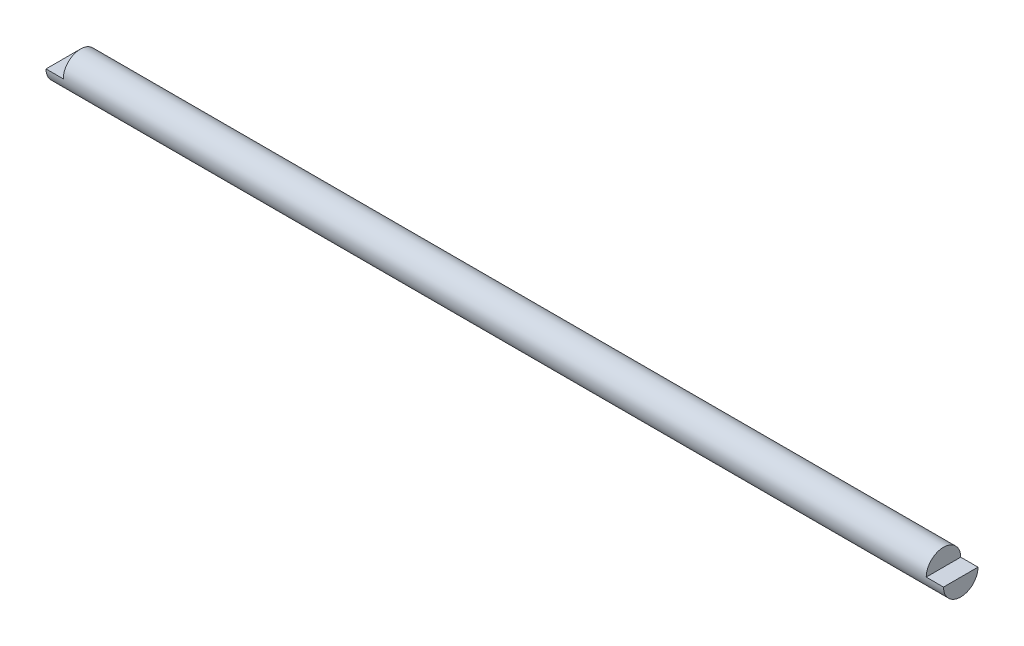
ISO-10303-21;
HEADER;
FILE_DESCRIPTION(('STEP AP214'),'2;1');
FILE_NAME('part.step','',(''),(''),'','','');
FILE_SCHEMA(('AUTOMOTIVE_DESIGN { 1 0 10303 214 1 1 1 1 }'));
ENDSEC;
DATA;
#1=APPLICATION_CONTEXT('core data for automotive mechanical design processes');
#2=APPLICATION_PROTOCOL_DEFINITION('international standard','automotive_design',2000,#1);
#3=PRODUCT_CONTEXT('',#1,'mechanical');
#4=PRODUCT('Part','Part','',(#3));
#5=PRODUCT_RELATED_PRODUCT_CATEGORY('part','',(#4));
#6=PRODUCT_DEFINITION_FORMATION('','',#4);
#7=PRODUCT_DEFINITION_CONTEXT('part definition',#1,'design');
#8=PRODUCT_DEFINITION('design','',#6,#7);
#9=PRODUCT_DEFINITION_SHAPE('','',#8);
#10=(LENGTH_UNIT() NAMED_UNIT(*) SI_UNIT(.MILLI.,.METRE.));
#11=(NAMED_UNIT(*) PLANE_ANGLE_UNIT() SI_UNIT($,.RADIAN.));
#12=(NAMED_UNIT(*) SI_UNIT($,.STERADIAN.) SOLID_ANGLE_UNIT());
#13=UNCERTAINTY_MEASURE_WITH_UNIT(LENGTH_MEASURE(1.E-05),#10,'distance_accuracy_value','');
#14=(GEOMETRIC_REPRESENTATION_CONTEXT(3) GLOBAL_UNCERTAINTY_ASSIGNED_CONTEXT((#13)) GLOBAL_UNIT_ASSIGNED_CONTEXT((#10,
#11,#12)) REPRESENTATION_CONTEXT('',''));
#15=CARTESIAN_POINT('',(0.,0.,0.));
#16=DIRECTION('',(0.,0.,1.));
#17=DIRECTION('',(1.,0.,0.));
#18=AXIS2_PLACEMENT_3D('',#15,#16,#17);
#19=CARTESIAN_POINT('',(330.2,0.,0.));
#20=DIRECTION('',(-1.,0.,0.));
#21=DIRECTION('',(0.,0.,1.));
#22=AXIS2_PLACEMENT_3D('',#19,#20,#21);
#23=CYLINDRICAL_SURFACE('',#22,6.35);
#24=CARTESIAN_POINT('',(323.85,0.,0.));
#25=DIRECTION('',(-1.,0.,0.));
#26=DIRECTION('',(0.,0.,1.));
#27=AXIS2_PLACEMENT_3D('',#24,#25,#26);
#28=CIRCLE('',#27,6.35);
#29=CARTESIAN_POINT('',(323.85,0.,6.35));
#30=VERTEX_POINT('',#29);
#31=CARTESIAN_POINT('',(323.85,0.,-6.35));
#32=VERTEX_POINT('',#31);
#33=EDGE_CURVE('E41',#30,#32,#28,.T.);
#34=ORIENTED_EDGE('',*,*,#33,.T.);
#35=DIRECTION('',(1.,0.,0.));
#36=VECTOR('',#35,1.);
#37=CARTESIAN_POINT('',(330.2,0.,-6.35));
#38=LINE('',#37,#36);
#39=CARTESIAN_POINT('',(330.2,0.,-6.35));
#40=VERTEX_POINT('',#39);
#41=EDGE_CURVE('E99',#32,#40,#38,.T.);
#42=ORIENTED_EDGE('',*,*,#41,.T.);
#43=CARTESIAN_POINT('',(330.2,0.,0.));
#44=DIRECTION('',(1.,0.,0.));
#45=DIRECTION('',(0.,0.,-1.));
#46=AXIS2_PLACEMENT_3D('',#43,#44,#45);
#47=CIRCLE('',#46,6.35);
#48=CARTESIAN_POINT('',(330.2,0.,6.35));
#49=VERTEX_POINT('',#48);
#50=EDGE_CURVE('E88',#49,#40,#47,.T.);
#51=ORIENTED_EDGE('',*,*,#50,.F.);
#52=DIRECTION('',(1.,0.,0.));
#53=VECTOR('',#52,1.);
#54=CARTESIAN_POINT('',(330.2,0.,6.35));
#55=LINE('',#54,#53);
#56=EDGE_CURVE('E48',#30,#49,#55,.T.);
#57=ORIENTED_EDGE('',*,*,#56,.F.);
#58=EDGE_LOOP('',(#34,#42,#51,#57));
#59=FACE_BOUND('',#58,.T.);
#60=DIRECTION('',(1.,0.,0.));
#61=VECTOR('',#60,1.);
#62=CARTESIAN_POINT('',(0.,0.,-6.35));
#63=LINE('',#62,#61);
#64=CARTESIAN_POINT('',(0.,0.,-6.35));
#65=VERTEX_POINT('',#64);
#66=CARTESIAN_POINT('',(6.35,0.,-6.35));
#67=VERTEX_POINT('',#66);
#68=EDGE_CURVE('E56',#65,#67,#63,.T.);
#69=ORIENTED_EDGE('',*,*,#68,.T.);
#70=CARTESIAN_POINT('',(6.35000000000002,0.,0.));
#71=DIRECTION('',(1.,0.,0.));
#72=DIRECTION('',(0.,0.,-1.));
#73=AXIS2_PLACEMENT_3D('',#70,#71,#72);
#74=CIRCLE('',#73,6.35);
#75=CARTESIAN_POINT('',(6.35,0.,6.35));
#76=VERTEX_POINT('',#75);
#77=EDGE_CURVE('E11',#67,#76,#74,.T.);
#78=ORIENTED_EDGE('',*,*,#77,.T.);
#79=DIRECTION('',(1.,0.,0.));
#80=VECTOR('',#79,1.);
#81=CARTESIAN_POINT('',(0.,0.,6.35));
#82=LINE('',#81,#80);
#83=CARTESIAN_POINT('',(0.,0.,6.35));
#84=VERTEX_POINT('',#83);
#85=EDGE_CURVE('E77',#84,#76,#82,.T.);
#86=ORIENTED_EDGE('',*,*,#85,.F.);
#87=CARTESIAN_POINT('',(0.,0.,0.));
#88=DIRECTION('',(1.,0.,0.));
#89=DIRECTION('',(0.,0.,-1.));
#90=AXIS2_PLACEMENT_3D('',#87,#88,#89);
#91=CIRCLE('',#90,6.35);
#92=EDGE_CURVE('E84',#84,#65,#91,.T.);
#93=ORIENTED_EDGE('',*,*,#92,.T.);
#94=EDGE_LOOP('',(#69,#78,#86,#93));
#95=FACE_BOUND('',#94,.T.);
#96=ADVANCED_FACE('F34',(#59,#95),#23,.T.);
#97=CARTESIAN_POINT('',(330.2,0.,0.));
#98=DIRECTION('',(1.,0.,0.));
#99=DIRECTION('',(0.,0.,-1.));
#100=AXIS2_PLACEMENT_3D('',#97,#98,#99);
#101=PLANE('',#100);
#102=DIRECTION('',(0.,0.,1.));
#103=VECTOR('',#102,1.);
#104=CARTESIAN_POINT('',(330.2,0.,-6.35));
#105=LINE('',#104,#103);
#106=EDGE_CURVE('E85',#40,#49,#105,.T.);
#107=ORIENTED_EDGE('',*,*,#106,.T.);
#108=ORIENTED_EDGE('',*,*,#50,.T.);
#109=EDGE_LOOP('',(#107,#108));
#110=FACE_BOUND('',#109,.T.);
#111=ADVANCED_FACE('F108',(#110),#101,.T.);
#112=CARTESIAN_POINT('',(0.,0.,0.));
#113=DIRECTION('',(1.,0.,0.));
#114=DIRECTION('',(0.,0.,-1.));
#115=AXIS2_PLACEMENT_3D('',#112,#113,#114);
#116=PLANE('',#115);
#117=ORIENTED_EDGE('',*,*,#92,.F.);
#118=DIRECTION('',(0.,0.,1.));
#119=VECTOR('',#118,1.);
#120=CARTESIAN_POINT('',(0.,0.,-6.35));
#121=LINE('',#120,#119);
#122=EDGE_CURVE('E74',#65,#84,#121,.T.);
#123=ORIENTED_EDGE('',*,*,#122,.F.);
#124=EDGE_LOOP('',(#117,#123));
#125=FACE_BOUND('',#124,.T.);
#126=ADVANCED_FACE('F87',(#125),#116,.F.);
#127=CARTESIAN_POINT('',(6.35,0.,-6.35));
#128=DIRECTION('',(1.,0.,0.));
#129=DIRECTION('',(0.,0.,-1.));
#130=AXIS2_PLACEMENT_3D('',#127,#128,#129);
#131=PLANE('',#130);
#132=DIRECTION('',(0.,0.,1.));
#133=VECTOR('',#132,1.);
#134=CARTESIAN_POINT('',(6.35,0.,-6.35));
#135=LINE('',#134,#133);
#136=EDGE_CURVE('E81',#67,#76,#135,.T.);
#137=ORIENTED_EDGE('',*,*,#136,.T.);
#138=ORIENTED_EDGE('',*,*,#77,.F.);
#139=EDGE_LOOP('',(#137,#138));
#140=FACE_BOUND('',#139,.T.);
#141=ADVANCED_FACE('F115',(#140),#131,.F.);
#142=CARTESIAN_POINT('',(0.,0.,-6.35));
#143=DIRECTION('',(0.,-1.,0.));
#144=DIRECTION('',(0.,0.,-1.));
#145=AXIS2_PLACEMENT_3D('',#142,#143,#144);
#146=PLANE('',#145);
#147=ORIENTED_EDGE('',*,*,#136,.F.);
#148=ORIENTED_EDGE('',*,*,#68,.F.);
#149=ORIENTED_EDGE('',*,*,#122,.T.);
#150=ORIENTED_EDGE('',*,*,#85,.T.);
#151=EDGE_LOOP('',(#147,#148,#149,#150));
#152=FACE_BOUND('',#151,.T.);
#153=ADVANCED_FACE('F76',(#152),#146,.F.);
#154=CARTESIAN_POINT('',(323.85,0.,-6.35));
#155=DIRECTION('',(-1.,0.,0.));
#156=DIRECTION('',(0.,0.,1.));
#157=AXIS2_PLACEMENT_3D('',#154,#155,#156);
#158=PLANE('',#157);
#159=DIRECTION('',(0.,0.,1.));
#160=VECTOR('',#159,1.);
#161=CARTESIAN_POINT('',(323.85,0.,-6.35));
#162=LINE('',#161,#160);
#163=EDGE_CURVE('E101',#32,#30,#162,.T.);
#164=ORIENTED_EDGE('',*,*,#163,.F.);
#165=ORIENTED_EDGE('',*,*,#33,.F.);
#166=EDGE_LOOP('',(#164,#165));
#167=FACE_BOUND('',#166,.T.);
#168=ADVANCED_FACE('F102',(#167),#158,.F.);
#169=CARTESIAN_POINT('',(330.2,0.,-6.35));
#170=DIRECTION('',(0.,-1.,0.));
#171=DIRECTION('',(0.,0.,-1.));
#172=AXIS2_PLACEMENT_3D('',#169,#170,#171);
#173=PLANE('',#172);
#174=ORIENTED_EDGE('',*,*,#106,.F.);
#175=ORIENTED_EDGE('',*,*,#41,.F.);
#176=ORIENTED_EDGE('',*,*,#163,.T.);
#177=ORIENTED_EDGE('',*,*,#56,.T.);
#178=EDGE_LOOP('',(#174,#175,#176,#177));
#179=FACE_BOUND('',#178,.T.);
#180=ADVANCED_FACE('F103',(#179),#173,.F.);
#181=CLOSED_SHELL('',(#96,#111,#126,#141,#153,#168,#180));
#182=MANIFOLD_SOLID_BREP('B2',#181);
#183=ADVANCED_BREP_SHAPE_REPRESENTATION('',(#18,#182),#14);
#184=SHAPE_DEFINITION_REPRESENTATION(#9,#183);
ENDSEC;
END-ISO-10303-21;
